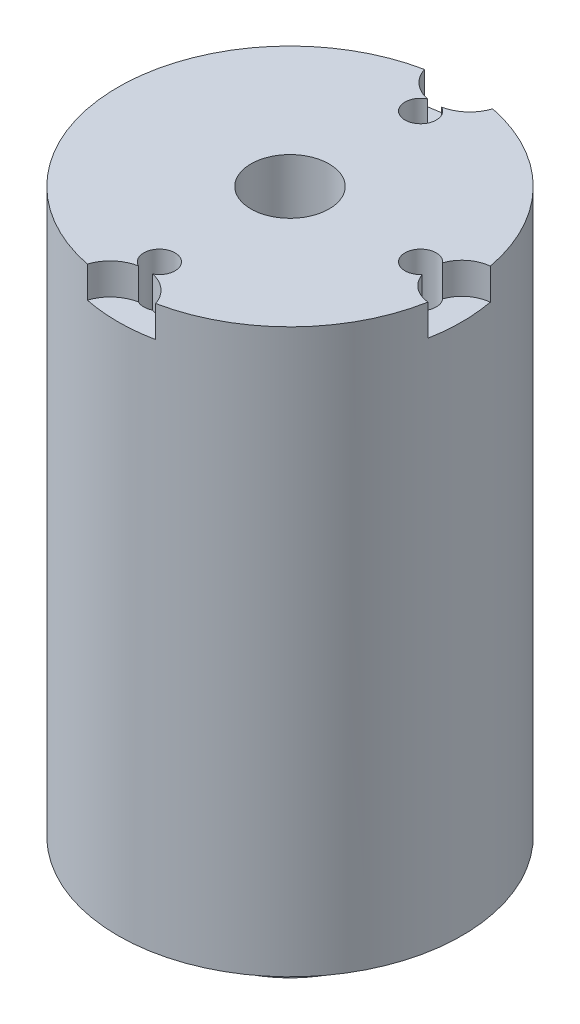
ISO-10303-21;
HEADER;
FILE_DESCRIPTION(('STEP AP214'),'2;1');
FILE_NAME('part.step','',(''),(''),'','','');
FILE_SCHEMA(('AUTOMOTIVE_DESIGN { 1 0 10303 214 1 1 1 1 }'));
ENDSEC;
DATA;
#1=APPLICATION_CONTEXT('core data for automotive mechanical design processes');
#2=APPLICATION_PROTOCOL_DEFINITION('international standard','automotive_design',2000,#1);
#3=PRODUCT_CONTEXT('',#1,'mechanical');
#4=PRODUCT('Part','Part','',(#3));
#5=PRODUCT_RELATED_PRODUCT_CATEGORY('part','',(#4));
#6=PRODUCT_DEFINITION_FORMATION('','',#4);
#7=PRODUCT_DEFINITION_CONTEXT('part definition',#1,'design');
#8=PRODUCT_DEFINITION('design','',#6,#7);
#9=PRODUCT_DEFINITION_SHAPE('','',#8);
#10=(LENGTH_UNIT() NAMED_UNIT(*) SI_UNIT(.MILLI.,.METRE.));
#11=(NAMED_UNIT(*) PLANE_ANGLE_UNIT() SI_UNIT($,.RADIAN.));
#12=(NAMED_UNIT(*) SI_UNIT($,.STERADIAN.) SOLID_ANGLE_UNIT());
#13=UNCERTAINTY_MEASURE_WITH_UNIT(LENGTH_MEASURE(1.E-05),#10,'distance_accuracy_value','');
#14=(GEOMETRIC_REPRESENTATION_CONTEXT(3) GLOBAL_UNCERTAINTY_ASSIGNED_CONTEXT((#13)) GLOBAL_UNIT_ASSIGNED_CONTEXT((#10,
#11,#12)) REPRESENTATION_CONTEXT('',''));
#15=CARTESIAN_POINT('',(0.,0.,0.));
#16=DIRECTION('',(0.,0.,1.));
#17=DIRECTION('',(1.,0.,0.));
#18=AXIS2_PLACEMENT_3D('',#15,#16,#17);
#19=CARTESIAN_POINT('',(0.,-1.,-5.75));
#20=DIRECTION('',(0.,1.,0.));
#21=DIRECTION('',(0.,0.,1.));
#22=AXIS2_PLACEMENT_3D('',#19,#20,#21);
#23=CYLINDRICAL_SURFACE('',#22,1.15);
#24=DIRECTION('',(0.,1.,0.));
#25=VECTOR('',#24,1.);
#26=CARTESIAN_POINT('',(0.226474082705401,-0.5,-4.62252073639346));
#27=LINE('',#26,#25);
#28=CARTESIAN_POINT('',(0.226474082705401,-1.,-4.62252073639346));
#29=VERTEX_POINT('',#28);
#30=CARTESIAN_POINT('',(0.226474082705401,0.,-4.62252073639346));
#31=VERTEX_POINT('',#30);
#32=EDGE_CURVE('E50',#29,#31,#27,.T.);
#33=ORIENTED_EDGE('',*,*,#32,.T.);
#34=CARTESIAN_POINT('',(0.,0.,-5.75));
#35=DIRECTION('',(0.,-1.,0.));
#36=DIRECTION('',(0.,0.,-1.));
#37=AXIS2_PLACEMENT_3D('',#34,#35,#36);
#38=CIRCLE('',#37,1.15);
#39=CARTESIAN_POINT('',(1.09234282825601,0.,-5.3904347826087));
#40=VERTEX_POINT('',#39);
#41=EDGE_CURVE('E146',#40,#31,#38,.T.);
#42=ORIENTED_EDGE('',*,*,#41,.F.);
#43=DIRECTION('',(0.,1.,0.));
#44=VECTOR('',#43,1.);
#45=CARTESIAN_POINT('',(1.09234282825601,-0.5,-5.3904347826087));
#46=LINE('',#45,#44);
#47=CARTESIAN_POINT('',(1.09234282825601,-1.,-5.3904347826087));
#48=VERTEX_POINT('',#47);
#49=EDGE_CURVE('E148',#48,#40,#46,.T.);
#50=ORIENTED_EDGE('',*,*,#49,.F.);
#51=CARTESIAN_POINT('',(0.,-1.,-5.75));
#52=DIRECTION('',(0.,-1.,0.));
#53=DIRECTION('',(0.,0.,-1.));
#54=AXIS2_PLACEMENT_3D('',#51,#52,#53);
#55=CIRCLE('',#54,1.15);
#56=EDGE_CURVE('E145',#48,#29,#55,.T.);
#57=ORIENTED_EDGE('',*,*,#56,.T.);
#58=EDGE_LOOP('',(#33,#42,#50,#57));
#59=FACE_BOUND('',#58,.T.);
#60=ADVANCED_FACE('F35',(#59),#23,.F.);
#61=CARTESIAN_POINT('',(5.5,-1.,0.));
#62=DIRECTION('',(0.,1.,0.));
#63=DIRECTION('',(0.,0.,1.));
#64=AXIS2_PLACEMENT_3D('',#61,#62,#63);
#65=CYLINDRICAL_SURFACE('',#64,1.);
#66=DIRECTION('',(0.,1.,0.));
#67=VECTOR('',#66,1.);
#68=CARTESIAN_POINT('',(4.55498249953494,-0.5,0.327019760587603));
#69=LINE('',#68,#67);
#70=CARTESIAN_POINT('',(4.55498249953494,-1.,0.327019760587603));
#71=VERTEX_POINT('',#70);
#72=CARTESIAN_POINT('',(4.55498249953494,0.,0.327019760587603));
#73=VERTEX_POINT('',#72);
#74=EDGE_CURVE('E58',#71,#73,#69,.T.);
#75=ORIENTED_EDGE('',*,*,#74,.T.);
#76=CARTESIAN_POINT('',(5.5,0.,0.));
#77=DIRECTION('',(0.,-1.,0.));
#78=DIRECTION('',(0.,0.,-1.));
#79=AXIS2_PLACEMENT_3D('',#76,#77,#78);
#80=CIRCLE('',#79,1.);
#81=CARTESIAN_POINT('',(5.40909090909091,0.,0.995859195463938));
#82=VERTEX_POINT('',#81);
#83=EDGE_CURVE('E165',#82,#73,#80,.T.);
#84=ORIENTED_EDGE('',*,*,#83,.F.);
#85=DIRECTION('',(0.,1.,0.));
#86=VECTOR('',#85,1.);
#87=CARTESIAN_POINT('',(5.40909090909091,-0.5,0.995859195463938));
#88=LINE('',#87,#86);
#89=CARTESIAN_POINT('',(5.40909090909091,-1.,0.995859195463938));
#90=VERTEX_POINT('',#89);
#91=EDGE_CURVE('E163',#90,#82,#88,.T.);
#92=ORIENTED_EDGE('',*,*,#91,.F.);
#93=CARTESIAN_POINT('',(5.5,-1.,0.));
#94=DIRECTION('',(0.,-1.,0.));
#95=DIRECTION('',(0.,0.,-1.));
#96=AXIS2_PLACEMENT_3D('',#93,#94,#95);
#97=CIRCLE('',#96,1.);
#98=EDGE_CURVE('E160',#90,#71,#97,.T.);
#99=ORIENTED_EDGE('',*,*,#98,.T.);
#100=EDGE_LOOP('',(#75,#84,#92,#99));
#101=FACE_BOUND('',#100,.T.);
#102=ADVANCED_FACE('F280',(#101),#65,.F.);
#103=CARTESIAN_POINT('',(0.,-1.,5.75));
#104=DIRECTION('',(0.,1.,0.));
#105=DIRECTION('',(0.,0.,1.));
#106=AXIS2_PLACEMENT_3D('',#103,#104,#105);
#107=CYLINDRICAL_SURFACE('',#106,1.15);
#108=DIRECTION('',(0.,1.,0.));
#109=VECTOR('',#108,1.);
#110=CARTESIAN_POINT('',(-0.226474082705424,-0.5,4.62252073639346));
#111=LINE('',#110,#109);
#112=CARTESIAN_POINT('',(-0.226474082705424,-1.,4.62252073639346));
#113=VERTEX_POINT('',#112);
#114=CARTESIAN_POINT('',(-0.226474082705423,0.,4.62252073639346));
#115=VERTEX_POINT('',#114);
#116=EDGE_CURVE('E227',#113,#115,#111,.T.);
#117=ORIENTED_EDGE('',*,*,#116,.T.);
#118=CARTESIAN_POINT('',(0.,0.,5.75));
#119=DIRECTION('',(0.,1.,0.));
#120=DIRECTION('',(0.,0.,1.));
#121=AXIS2_PLACEMENT_3D('',#118,#119,#120);
#122=CIRCLE('',#121,1.15);
#123=CARTESIAN_POINT('',(-1.09234282825601,0.,5.3904347826087));
#124=VERTEX_POINT('',#123);
#125=EDGE_CURVE('E43',#124,#115,#122,.F.);
#126=ORIENTED_EDGE('',*,*,#125,.F.);
#127=DIRECTION('',(0.,1.,0.));
#128=VECTOR('',#127,1.);
#129=CARTESIAN_POINT('',(-1.09234282825601,-0.5,5.3904347826087));
#130=LINE('',#129,#128);
#131=CARTESIAN_POINT('',(-1.09234282825601,-1.,5.3904347826087));
#132=VERTEX_POINT('',#131);
#133=EDGE_CURVE('E216',#132,#124,#130,.T.);
#134=ORIENTED_EDGE('',*,*,#133,.F.);
#135=CARTESIAN_POINT('',(0.,-1.,5.75));
#136=DIRECTION('',(0.,-1.,0.));
#137=DIRECTION('',(0.,0.,-1.));
#138=AXIS2_PLACEMENT_3D('',#135,#136,#137);
#139=CIRCLE('',#138,1.15);
#140=EDGE_CURVE('E223',#132,#113,#139,.T.);
#141=ORIENTED_EDGE('',*,*,#140,.T.);
#142=EDGE_LOOP('',(#117,#126,#134,#141));
#143=FACE_BOUND('',#142,.T.);
#144=ADVANCED_FACE('F286',(#143),#107,.F.);
#145=CARTESIAN_POINT('',(0.,-18.,0.));
#146=DIRECTION('',(0.,1.,0.));
#147=DIRECTION('',(0.,0.,1.));
#148=AXIS2_PLACEMENT_3D('',#145,#146,#147);
#149=CYLINDRICAL_SURFACE('',#148,5.5);
#150=CARTESIAN_POINT('',(0.,-18.,0.));
#151=DIRECTION('',(0.,1.,0.));
#152=DIRECTION('',(0.,0.,1.));
#153=AXIS2_PLACEMENT_3D('',#150,#151,#152);
#154=CIRCLE('',#153,5.5);
#155=CARTESIAN_POINT('',(0.,-18.,5.5));
#156=VERTEX_POINT('',#155);
#157=EDGE_CURVE('E183',#156,#156,#154,.T.);
#158=ORIENTED_EDGE('',*,*,#157,.T.);
#159=EDGE_LOOP('',(#158));
#160=FACE_BOUND('',#159,.T.);
#161=CARTESIAN_POINT('',(0.,0.,0.));
#162=DIRECTION('',(0.,1.,0.));
#163=DIRECTION('',(0.,0.,1.));
#164=AXIS2_PLACEMENT_3D('',#161,#162,#163);
#165=CIRCLE('',#164,5.5);
#166=CARTESIAN_POINT('',(1.09234282825601,0.,5.3904347826087));
#167=VERTEX_POINT('',#166);
#168=EDGE_CURVE('E182',#167,#82,#165,.T.);
#169=ORIENTED_EDGE('',*,*,#168,.F.);
#170=DIRECTION('',(0.,1.,0.));
#171=VECTOR('',#170,1.);
#172=CARTESIAN_POINT('',(1.09234282825601,-0.5,5.3904347826087));
#173=LINE('',#172,#171);
#174=CARTESIAN_POINT('',(1.09234282825601,-1.,5.3904347826087));
#175=VERTEX_POINT('',#174);
#176=EDGE_CURVE('E152',#167,#175,#173,.F.);
#177=ORIENTED_EDGE('',*,*,#176,.T.);
#178=CARTESIAN_POINT('',(0.,-1.,0.));
#179=DIRECTION('',(0.,-1.,0.));
#180=DIRECTION('',(0.,0.,-1.));
#181=AXIS2_PLACEMENT_3D('',#178,#179,#180);
#182=CIRCLE('',#181,5.5);
#183=EDGE_CURVE('E11',#132,#175,#182,.F.);
#184=ORIENTED_EDGE('',*,*,#183,.F.);
#185=ORIENTED_EDGE('',*,*,#133,.T.);
#186=CARTESIAN_POINT('',(-1.09234282825601,0.,-5.3904347826087));
#187=VERTEX_POINT('',#186);
#188=EDGE_CURVE('E190',#187,#124,#165,.T.);
#189=ORIENTED_EDGE('',*,*,#188,.F.);
#190=DIRECTION('',(0.,1.,0.));
#191=VECTOR('',#190,1.);
#192=CARTESIAN_POINT('',(-1.09234282825601,-0.5,-5.3904347826087));
#193=LINE('',#192,#191);
#194=CARTESIAN_POINT('',(-1.09234282825601,-1.,-5.3904347826087));
#195=VERTEX_POINT('',#194);
#196=EDGE_CURVE('E157',#187,#195,#193,.F.);
#197=ORIENTED_EDGE('',*,*,#196,.T.);
#198=CARTESIAN_POINT('',(0.,-1.,0.));
#199=DIRECTION('',(0.,-1.,0.));
#200=DIRECTION('',(0.,0.,-1.));
#201=AXIS2_PLACEMENT_3D('',#198,#199,#200);
#202=CIRCLE('',#201,5.5);
#203=EDGE_CURVE('E143',#48,#195,#202,.F.);
#204=ORIENTED_EDGE('',*,*,#203,.F.);
#205=ORIENTED_EDGE('',*,*,#49,.T.);
#206=CARTESIAN_POINT('',(5.40909090909091,0.,-0.99585919546394));
#207=VERTEX_POINT('',#206);
#208=EDGE_CURVE('E187',#207,#40,#165,.T.);
#209=ORIENTED_EDGE('',*,*,#208,.F.);
#210=DIRECTION('',(0.,1.,0.));
#211=VECTOR('',#210,1.);
#212=CARTESIAN_POINT('',(5.40909090909091,-0.5,-0.995859195463938));
#213=LINE('',#212,#211);
#214=CARTESIAN_POINT('',(5.40909090909091,-1.,-0.995859195463938));
#215=VERTEX_POINT('',#214);
#216=EDGE_CURVE('E170',#207,#215,#213,.F.);
#217=ORIENTED_EDGE('',*,*,#216,.T.);
#218=CARTESIAN_POINT('',(0.,-1.,0.));
#219=DIRECTION('',(0.,-1.,0.));
#220=DIRECTION('',(0.,0.,-1.));
#221=AXIS2_PLACEMENT_3D('',#218,#219,#220);
#222=CIRCLE('',#221,5.5);
#223=EDGE_CURVE('E193',#90,#215,#222,.F.);
#224=ORIENTED_EDGE('',*,*,#223,.F.);
#225=ORIENTED_EDGE('',*,*,#91,.T.);
#226=EDGE_LOOP('',(#169,#177,#184,#185,#189,#197,#204,#205,#209,#217,#224,#225));
#227=FACE_BOUND('',#226,.T.);
#228=ADVANCED_FACE('F37',(#160,#227),#149,.T.);
#229=CARTESIAN_POINT('',(0.,0.,0.));
#230=DIRECTION('',(0.,1.,0.));
#231=DIRECTION('',(0.,0.,1.));
#232=AXIS2_PLACEMENT_3D('',#229,#230,#231);
#233=PLANE('',#232);
#234=CARTESIAN_POINT('',(0.,0.,-4.17675231011953));
#235=DIRECTION('',(0.,1.,0.));
#236=DIRECTION('',(0.,0.,1.));
#237=AXIS2_PLACEMENT_3D('',#234,#235,#236);
#238=CIRCLE('',#237,0.5);
#239=CARTESIAN_POINT('',(-0.226474082705442,0.,-4.62252073639347));
#240=VERTEX_POINT('',#239);
#241=EDGE_CURVE('E249',#31,#240,#238,.F.);
#242=ORIENTED_EDGE('',*,*,#241,.T.);
#243=EDGE_CURVE('E139',#240,#187,#38,.T.);
#244=ORIENTED_EDGE('',*,*,#243,.T.);
#245=ORIENTED_EDGE('',*,*,#188,.T.);
#246=ORIENTED_EDGE('',*,*,#125,.T.);
#247=CARTESIAN_POINT('',(0.,0.,4.17675231011953));
#248=DIRECTION('',(0.,1.,0.));
#249=DIRECTION('',(0.,0.,1.));
#250=AXIS2_PLACEMENT_3D('',#247,#248,#249);
#251=CIRCLE('',#250,0.5);
#252=CARTESIAN_POINT('',(0.226474082705424,0.,4.62252073639346));
#253=VERTEX_POINT('',#252);
#254=EDGE_CURVE('E207',#115,#253,#251,.F.);
#255=ORIENTED_EDGE('',*,*,#254,.T.);
#256=EDGE_CURVE('E196',#253,#167,#122,.F.);
#257=ORIENTED_EDGE('',*,*,#256,.T.);
#258=ORIENTED_EDGE('',*,*,#168,.T.);
#259=ORIENTED_EDGE('',*,*,#83,.T.);
#260=CARTESIAN_POINT('',(4.17675231011953,0.,0.));
#261=DIRECTION('',(0.,1.,0.));
#262=DIRECTION('',(0.,0.,1.));
#263=AXIS2_PLACEMENT_3D('',#260,#261,#262);
#264=CIRCLE('',#263,0.5);
#265=CARTESIAN_POINT('',(4.55498249953495,0.,-0.327019760587625));
#266=VERTEX_POINT('',#265);
#267=EDGE_CURVE('E237',#73,#266,#264,.F.);
#268=ORIENTED_EDGE('',*,*,#267,.T.);
#269=EDGE_CURVE('E159',#266,#207,#80,.T.);
#270=ORIENTED_EDGE('',*,*,#269,.T.);
#271=ORIENTED_EDGE('',*,*,#208,.T.);
#272=ORIENTED_EDGE('',*,*,#41,.T.);
#273=EDGE_LOOP('',(#242,#244,#245,#246,#255,#257,#258,#259,#268,#270,#271,#272));
#274=FACE_BOUND('',#273,.T.);
#275=CARTESIAN_POINT('',(0.,0.,0.));
#276=DIRECTION('',(0.,-1.,0.));
#277=DIRECTION('',(0.,0.,-1.));
#278=AXIS2_PLACEMENT_3D('',#275,#276,#277);
#279=CIRCLE('',#278,1.25);
#280=CARTESIAN_POINT('',(0.,0.,-1.25));
#281=VERTEX_POINT('',#280);
#282=EDGE_CURVE('E174',#281,#281,#279,.T.);
#283=ORIENTED_EDGE('',*,*,#282,.T.);
#284=EDGE_LOOP('',(#283));
#285=FACE_BOUND('',#284,.T.);
#286=ADVANCED_FACE('F203',(#274,#285),#233,.T.);
#287=CARTESIAN_POINT('',(0.,-18.,0.));
#288=DIRECTION('',(0.,1.,0.));
#289=DIRECTION('',(0.,0.,1.));
#290=AXIS2_PLACEMENT_3D('',#287,#288,#289);
#291=PLANE('',#290);
#292=CARTESIAN_POINT('',(0.,-18.,-4.17675231011953));
#293=DIRECTION('',(0.,-1.,0.));
#294=DIRECTION('',(0.,0.,1.));
#295=AXIS2_PLACEMENT_3D('',#292,#293,#294);
#296=CIRCLE('',#295,0.5);
#297=CARTESIAN_POINT('',(0.,-18.,-3.67675231011953));
#298=VERTEX_POINT('',#297);
#299=EDGE_CURVE('E131',#298,#298,#296,.T.);
#300=ORIENTED_EDGE('',*,*,#299,.F.);
#301=EDGE_LOOP('',(#300));
#302=FACE_BOUND('',#301,.T.);
#303=CARTESIAN_POINT('',(4.17675231011953,-18.,0.));
#304=DIRECTION('',(0.,-1.,0.));
#305=DIRECTION('',(-1.,0.,0.));
#306=AXIS2_PLACEMENT_3D('',#303,#304,#305);
#307=CIRCLE('',#306,0.5);
#308=CARTESIAN_POINT('',(3.67675231011953,-18.,0.));
#309=VERTEX_POINT('',#308);
#310=EDGE_CURVE('E246',#309,#309,#307,.T.);
#311=ORIENTED_EDGE('',*,*,#310,.F.);
#312=EDGE_LOOP('',(#311));
#313=FACE_BOUND('',#312,.T.);
#314=CARTESIAN_POINT('',(0.,-18.,4.17675231011953));
#315=DIRECTION('',(0.,-1.,0.));
#316=DIRECTION('',(0.,0.,-1.));
#317=AXIS2_PLACEMENT_3D('',#314,#315,#316);
#318=CIRCLE('',#317,0.5);
#319=CARTESIAN_POINT('',(0.,-18.,3.67675231011953));
#320=VERTEX_POINT('',#319);
#321=EDGE_CURVE('E234',#320,#320,#318,.T.);
#322=ORIENTED_EDGE('',*,*,#321,.F.);
#323=EDGE_LOOP('',(#322));
#324=FACE_BOUND('',#323,.T.);
#325=ORIENTED_EDGE('',*,*,#157,.F.);
#326=EDGE_LOOP('',(#325));
#327=FACE_BOUND('',#326,.T.);
#328=CARTESIAN_POINT('',(0.,-18.,0.));
#329=DIRECTION('',(0.,1.,0.));
#330=DIRECTION('',(0.,0.,1.));
#331=AXIS2_PLACEMENT_3D('',#328,#329,#330);
#332=CIRCLE('',#331,3.);
#333=CARTESIAN_POINT('',(0.,-18.,3.));
#334=VERTEX_POINT('',#333);
#335=EDGE_CURVE('E186',#334,#334,#332,.F.);
#336=ORIENTED_EDGE('',*,*,#335,.F.);
#337=EDGE_LOOP('',(#336));
#338=FACE_BOUND('',#337,.T.);
#339=ADVANCED_FACE('F255',(#302,#313,#324,#327,#338),#291,.F.);
#340=CARTESIAN_POINT('',(0.,-19.8,0.));
#341=DIRECTION('',(0.,1.,0.));
#342=DIRECTION('',(0.,0.,1.));
#343=AXIS2_PLACEMENT_3D('',#340,#341,#342);
#344=CYLINDRICAL_SURFACE('',#343,3.);
#345=CARTESIAN_POINT('',(0.,-19.8,0.));
#346=DIRECTION('',(0.,-1.,0.));
#347=DIRECTION('',(0.,0.,-1.));
#348=AXIS2_PLACEMENT_3D('',#345,#346,#347);
#349=CIRCLE('',#348,3.);
#350=CARTESIAN_POINT('',(0.,-19.8,-3.));
#351=VERTEX_POINT('',#350);
#352=EDGE_CURVE('E177',#351,#351,#349,.T.);
#353=ORIENTED_EDGE('',*,*,#352,.F.);
#354=EDGE_LOOP('',(#353));
#355=FACE_BOUND('',#354,.T.);
#356=ORIENTED_EDGE('',*,*,#335,.T.);
#357=EDGE_LOOP('',(#356));
#358=FACE_BOUND('',#357,.T.);
#359=ADVANCED_FACE('F258',(#355,#358),#344,.T.);
#360=CARTESIAN_POINT('',(0.,-19.8,0.));
#361=DIRECTION('',(0.,-1.,0.));
#362=DIRECTION('',(0.,0.,-1.));
#363=AXIS2_PLACEMENT_3D('',#360,#361,#362);
#364=PLANE('',#363);
#365=CARTESIAN_POINT('',(0.,-19.8,0.));
#366=DIRECTION('',(0.,-1.,0.));
#367=DIRECTION('',(0.,0.,-1.));
#368=AXIS2_PLACEMENT_3D('',#365,#366,#367);
#369=CIRCLE('',#368,1.25);
#370=CARTESIAN_POINT('',(0.,-19.8,-1.25));
#371=VERTEX_POINT('',#370);
#372=EDGE_CURVE('E173',#371,#371,#369,.T.);
#373=ORIENTED_EDGE('',*,*,#372,.F.);
#374=EDGE_LOOP('',(#373));
#375=FACE_BOUND('',#374,.T.);
#376=ORIENTED_EDGE('',*,*,#352,.T.);
#377=EDGE_LOOP('',(#376));
#378=FACE_BOUND('',#377,.T.);
#379=ADVANCED_FACE('F269',(#375,#378),#364,.T.);
#380=CARTESIAN_POINT('',(0.,0.,0.));
#381=DIRECTION('',(0.,-1.,0.));
#382=DIRECTION('',(0.,0.,-1.));
#383=AXIS2_PLACEMENT_3D('',#380,#381,#382);
#384=CYLINDRICAL_SURFACE('',#383,1.25);
#385=ORIENTED_EDGE('',*,*,#282,.F.);
#386=EDGE_LOOP('',(#385));
#387=FACE_BOUND('',#386,.T.);
#388=ORIENTED_EDGE('',*,*,#372,.T.);
#389=EDGE_LOOP('',(#388));
#390=FACE_BOUND('',#389,.T.);
#391=ADVANCED_FACE('F275',(#387,#390),#384,.F.);
#392=DIRECTION('',(0.,1.,0.));
#393=VECTOR('',#392,1.);
#394=CARTESIAN_POINT('',(4.55498249953495,-0.5,-0.327019760587624));
#395=LINE('',#394,#393);
#396=CARTESIAN_POINT('',(4.55498249953495,-1.,-0.327019760587624));
#397=VERTEX_POINT('',#396);
#398=EDGE_CURVE('E241',#266,#397,#395,.F.);
#399=ORIENTED_EDGE('',*,*,#398,.T.);
#400=EDGE_CURVE('E164',#397,#215,#97,.T.);
#401=ORIENTED_EDGE('',*,*,#400,.T.);
#402=ORIENTED_EDGE('',*,*,#216,.F.);
#403=ORIENTED_EDGE('',*,*,#269,.F.);
#404=EDGE_LOOP('',(#399,#401,#402,#403));
#405=FACE_BOUND('',#404,.T.);
#406=ADVANCED_FACE('F289',(#405),#65,.F.);
#407=CARTESIAN_POINT('',(5.5,-1.,0.));
#408=DIRECTION('',(0.,-1.,0.));
#409=DIRECTION('',(0.,0.,-1.));
#410=AXIS2_PLACEMENT_3D('',#407,#408,#409);
#411=PLANE('',#410);
#412=ORIENTED_EDGE('',*,*,#400,.F.);
#413=CARTESIAN_POINT('',(4.17675231011953,-1.,0.));
#414=DIRECTION('',(0.,-1.,0.));
#415=DIRECTION('',(0.,0.,-1.));
#416=AXIS2_PLACEMENT_3D('',#413,#414,#415);
#417=CIRCLE('',#416,0.5);
#418=EDGE_CURVE('E244',#71,#397,#417,.F.);
#419=ORIENTED_EDGE('',*,*,#418,.F.);
#420=ORIENTED_EDGE('',*,*,#98,.F.);
#421=ORIENTED_EDGE('',*,*,#223,.T.);
#422=EDGE_LOOP('',(#412,#419,#420,#421));
#423=FACE_BOUND('',#422,.T.);
#424=ADVANCED_FACE('F293',(#423),#411,.F.);
#425=DIRECTION('',(0.,1.,0.));
#426=VECTOR('',#425,1.);
#427=CARTESIAN_POINT('',(-0.226474082705442,-0.5,-4.62252073639347));
#428=LINE('',#427,#426);
#429=CARTESIAN_POINT('',(-0.226474082705442,-1.,-4.62252073639347));
#430=VERTEX_POINT('',#429);
#431=EDGE_CURVE('E125',#240,#430,#428,.F.);
#432=ORIENTED_EDGE('',*,*,#431,.T.);
#433=EDGE_CURVE('E137',#430,#195,#55,.T.);
#434=ORIENTED_EDGE('',*,*,#433,.T.);
#435=ORIENTED_EDGE('',*,*,#196,.F.);
#436=ORIENTED_EDGE('',*,*,#243,.F.);
#437=EDGE_LOOP('',(#432,#434,#435,#436));
#438=FACE_BOUND('',#437,.T.);
#439=ADVANCED_FACE('F135',(#438),#23,.F.);
#440=CARTESIAN_POINT('',(0.,-1.,-5.75));
#441=DIRECTION('',(0.,-1.,0.));
#442=DIRECTION('',(0.,0.,-1.));
#443=AXIS2_PLACEMENT_3D('',#440,#441,#442);
#444=PLANE('',#443);
#445=ORIENTED_EDGE('',*,*,#433,.F.);
#446=CARTESIAN_POINT('',(0.,-1.,-4.17675231011953));
#447=DIRECTION('',(0.,-1.,0.));
#448=DIRECTION('',(0.,0.,-1.));
#449=AXIS2_PLACEMENT_3D('',#446,#447,#448);
#450=CIRCLE('',#449,0.5);
#451=EDGE_CURVE('E121',#29,#430,#450,.F.);
#452=ORIENTED_EDGE('',*,*,#451,.F.);
#453=ORIENTED_EDGE('',*,*,#56,.F.);
#454=ORIENTED_EDGE('',*,*,#203,.T.);
#455=EDGE_LOOP('',(#445,#452,#453,#454));
#456=FACE_BOUND('',#455,.T.);
#457=ADVANCED_FACE('F141',(#456),#444,.F.);
#458=DIRECTION('',(0.,1.,0.));
#459=VECTOR('',#458,1.);
#460=CARTESIAN_POINT('',(0.226474082705424,-0.5,4.62252073639346));
#461=LINE('',#460,#459);
#462=CARTESIAN_POINT('',(0.226474082705425,-1.,4.62252073639346));
#463=VERTEX_POINT('',#462);
#464=EDGE_CURVE('E230',#253,#463,#461,.F.);
#465=ORIENTED_EDGE('',*,*,#464,.T.);
#466=EDGE_CURVE('E213',#463,#175,#139,.T.);
#467=ORIENTED_EDGE('',*,*,#466,.T.);
#468=ORIENTED_EDGE('',*,*,#176,.F.);
#469=ORIENTED_EDGE('',*,*,#256,.F.);
#470=EDGE_LOOP('',(#465,#467,#468,#469));
#471=FACE_BOUND('',#470,.T.);
#472=ADVANCED_FACE('F211',(#471),#107,.F.);
#473=CARTESIAN_POINT('',(0.,-1.,5.75));
#474=DIRECTION('',(0.,-1.,0.));
#475=DIRECTION('',(0.,0.,-1.));
#476=AXIS2_PLACEMENT_3D('',#473,#474,#475);
#477=PLANE('',#476);
#478=ORIENTED_EDGE('',*,*,#466,.F.);
#479=CARTESIAN_POINT('',(0.,-1.,4.17675231011953));
#480=DIRECTION('',(0.,-1.,0.));
#481=DIRECTION('',(0.,0.,-1.));
#482=AXIS2_PLACEMENT_3D('',#479,#480,#481);
#483=CIRCLE('',#482,0.5);
#484=EDGE_CURVE('E232',#113,#463,#483,.F.);
#485=ORIENTED_EDGE('',*,*,#484,.F.);
#486=ORIENTED_EDGE('',*,*,#140,.F.);
#487=ORIENTED_EDGE('',*,*,#183,.T.);
#488=EDGE_LOOP('',(#478,#485,#486,#487));
#489=FACE_BOUND('',#488,.T.);
#490=ADVANCED_FACE('F326',(#489),#477,.F.);
#491=CARTESIAN_POINT('',(0.,0.001000000000001,4.17675231011953));
#492=DIRECTION('',(0.,-1.,0.));
#493=DIRECTION('',(0.,0.,-1.));
#494=AXIS2_PLACEMENT_3D('',#491,#492,#493);
#495=CYLINDRICAL_SURFACE('',#494,0.5);
#496=ORIENTED_EDGE('',*,*,#116,.F.);
#497=ORIENTED_EDGE('',*,*,#484,.T.);
#498=ORIENTED_EDGE('',*,*,#464,.F.);
#499=ORIENTED_EDGE('',*,*,#254,.F.);
#500=EDGE_LOOP('',(#496,#497,#498,#499));
#501=FACE_BOUND('',#500,.T.);
#502=ORIENTED_EDGE('',*,*,#321,.T.);
#503=EDGE_LOOP('',(#502));
#504=FACE_BOUND('',#503,.T.);
#505=ADVANCED_FACE('F330',(#501,#504),#495,.F.);
#506=CARTESIAN_POINT('',(4.17675231011953,0.001000000000001,0.));
#507=DIRECTION('',(0.,-1.,0.));
#508=DIRECTION('',(0.,0.,-1.));
#509=AXIS2_PLACEMENT_3D('',#506,#507,#508);
#510=CYLINDRICAL_SURFACE('',#509,0.5);
#511=ORIENTED_EDGE('',*,*,#74,.F.);
#512=ORIENTED_EDGE('',*,*,#418,.T.);
#513=ORIENTED_EDGE('',*,*,#398,.F.);
#514=ORIENTED_EDGE('',*,*,#267,.F.);
#515=EDGE_LOOP('',(#511,#512,#513,#514));
#516=FACE_BOUND('',#515,.T.);
#517=ORIENTED_EDGE('',*,*,#310,.T.);
#518=EDGE_LOOP('',(#517));
#519=FACE_BOUND('',#518,.T.);
#520=ADVANCED_FACE('F335',(#516,#519),#510,.F.);
#521=CARTESIAN_POINT('',(0.,0.001000000000001,-4.17675231011953));
#522=DIRECTION('',(0.,-1.,0.));
#523=DIRECTION('',(0.,0.,-1.));
#524=AXIS2_PLACEMENT_3D('',#521,#522,#523);
#525=CYLINDRICAL_SURFACE('',#524,0.5);
#526=ORIENTED_EDGE('',*,*,#32,.F.);
#527=ORIENTED_EDGE('',*,*,#451,.T.);
#528=ORIENTED_EDGE('',*,*,#431,.F.);
#529=ORIENTED_EDGE('',*,*,#241,.F.);
#530=EDGE_LOOP('',(#526,#527,#528,#529));
#531=FACE_BOUND('',#530,.T.);
#532=ORIENTED_EDGE('',*,*,#299,.T.);
#533=EDGE_LOOP('',(#532));
#534=FACE_BOUND('',#533,.T.);
#535=ADVANCED_FACE('F123',(#531,#534),#525,.F.);
#536=CLOSED_SHELL('',(#60,#102,#144,#228,#286,#339,#359,#379,#391,#406,#424,#439,#457,#472,#490,
#505,#520,#535));
#537=MANIFOLD_SOLID_BREP('B2',#536);
#538=ADVANCED_BREP_SHAPE_REPRESENTATION('',(#18,#537),#14);
#539=SHAPE_DEFINITION_REPRESENTATION(#9,#538);
ENDSEC;
END-ISO-10303-21;
